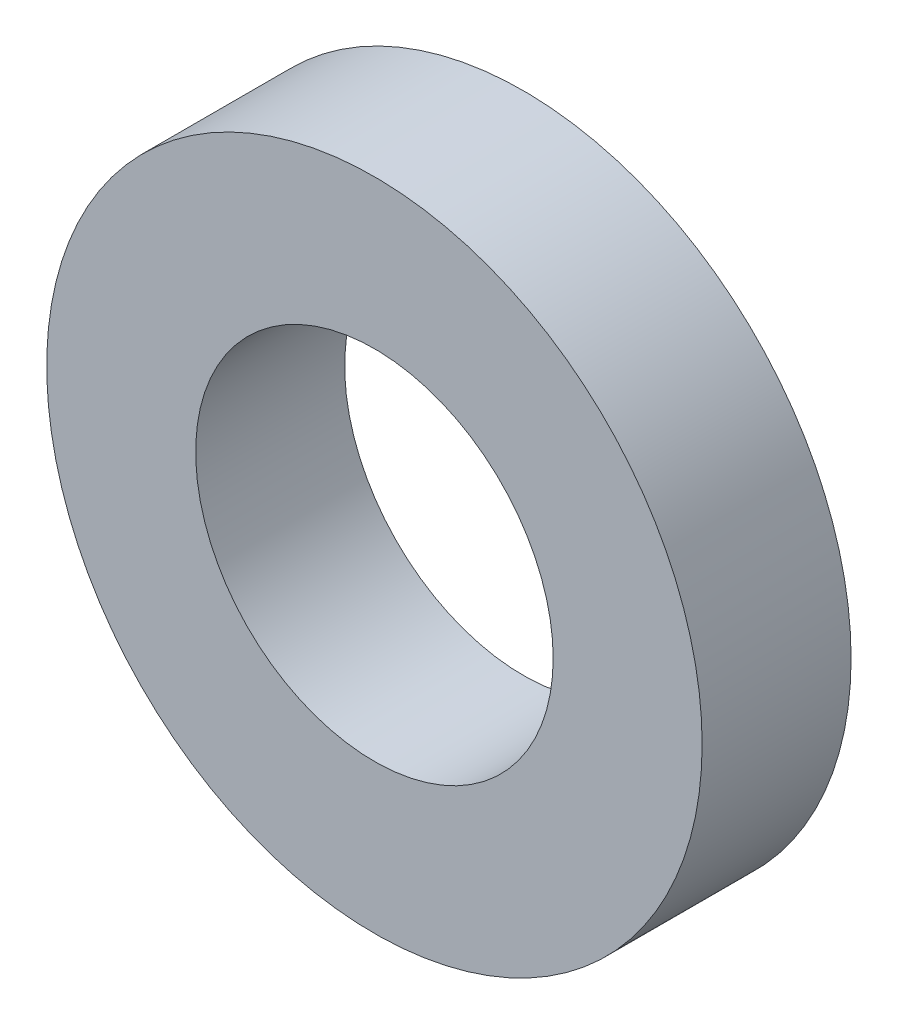
ISO-10303-21;
HEADER;
FILE_DESCRIPTION(('STEP AP214'),'2;1');
FILE_NAME('part.step','',(''),(''),'','','');
FILE_SCHEMA(('AUTOMOTIVE_DESIGN { 1 0 10303 214 1 1 1 1 }'));
ENDSEC;
DATA;
#1=APPLICATION_CONTEXT('core data for automotive mechanical design processes');
#2=APPLICATION_PROTOCOL_DEFINITION('international standard','automotive_design',2000,#1);
#3=PRODUCT_CONTEXT('',#1,'mechanical');
#4=PRODUCT('Part','Part','',(#3));
#5=PRODUCT_RELATED_PRODUCT_CATEGORY('part','',(#4));
#6=PRODUCT_DEFINITION_FORMATION('','',#4);
#7=PRODUCT_DEFINITION_CONTEXT('part definition',#1,'design');
#8=PRODUCT_DEFINITION('design','',#6,#7);
#9=PRODUCT_DEFINITION_SHAPE('','',#8);
#10=(LENGTH_UNIT() NAMED_UNIT(*) SI_UNIT(.MILLI.,.METRE.));
#11=(NAMED_UNIT(*) PLANE_ANGLE_UNIT() SI_UNIT($,.RADIAN.));
#12=(NAMED_UNIT(*) SI_UNIT($,.STERADIAN.) SOLID_ANGLE_UNIT());
#13=UNCERTAINTY_MEASURE_WITH_UNIT(LENGTH_MEASURE(1.E-05),#10,'distance_accuracy_value','');
#14=(GEOMETRIC_REPRESENTATION_CONTEXT(3) GLOBAL_UNCERTAINTY_ASSIGNED_CONTEXT((#13)) GLOBAL_UNIT_ASSIGNED_CONTEXT((#10,
#11,#12)) REPRESENTATION_CONTEXT('',''));
#15=CARTESIAN_POINT('',(0.,0.,0.));
#16=DIRECTION('',(0.,0.,1.));
#17=DIRECTION('',(1.,0.,0.));
#18=AXIS2_PLACEMENT_3D('',#15,#16,#17);
#19=CARTESIAN_POINT('',(0.,0.,5.));
#20=DIRECTION('',(0.,0.,1.));
#21=DIRECTION('',(1.,0.,0.));
#22=AXIS2_PLACEMENT_3D('',#19,#20,#21);
#23=PLANE('',#22);
#24=CARTESIAN_POINT('',(0.,0.,5.));
#25=DIRECTION('',(0.,0.,1.));
#26=DIRECTION('',(1.,0.,0.));
#27=AXIS2_PLACEMENT_3D('',#24,#25,#26);
#28=CIRCLE('',#27,11.);
#29=CARTESIAN_POINT('',(11.,0.,5.));
#30=VERTEX_POINT('',#29);
#31=EDGE_CURVE('E12',#30,#30,#28,.T.);
#32=ORIENTED_EDGE('',*,*,#31,.T.);
#33=EDGE_LOOP('',(#32));
#34=FACE_BOUND('',#33,.T.);
#35=CARTESIAN_POINT('',(0.,0.,5.));
#36=DIRECTION('',(0.,0.,1.));
#37=DIRECTION('',(1.,0.,0.));
#38=AXIS2_PLACEMENT_3D('',#35,#36,#37);
#39=CIRCLE('',#38,6.);
#40=CARTESIAN_POINT('',(6.,0.,5.));
#41=VERTEX_POINT('',#40);
#42=EDGE_CURVE('E51',#41,#41,#39,.T.);
#43=ORIENTED_EDGE('',*,*,#42,.F.);
#44=EDGE_LOOP('',(#43));
#45=FACE_BOUND('',#44,.T.);
#46=ADVANCED_FACE('F40',(#34,#45),#23,.T.);
#47=CARTESIAN_POINT('',(0.,0.,0.));
#48=DIRECTION('',(0.,0.,1.));
#49=DIRECTION('',(1.,0.,0.));
#50=AXIS2_PLACEMENT_3D('',#47,#48,#49);
#51=PLANE('',#50);
#52=CARTESIAN_POINT('',(0.,0.,0.));
#53=DIRECTION('',(0.,0.,1.));
#54=DIRECTION('',(1.,0.,0.));
#55=AXIS2_PLACEMENT_3D('',#52,#53,#54);
#56=CIRCLE('',#55,11.);
#57=CARTESIAN_POINT('',(11.,0.,0.));
#58=VERTEX_POINT('',#57);
#59=EDGE_CURVE('E44',#58,#58,#56,.T.);
#60=ORIENTED_EDGE('',*,*,#59,.F.);
#61=EDGE_LOOP('',(#60));
#62=FACE_BOUND('',#61,.T.);
#63=CARTESIAN_POINT('',(0.,0.,0.));
#64=DIRECTION('',(0.,0.,1.));
#65=DIRECTION('',(1.,0.,0.));
#66=AXIS2_PLACEMENT_3D('',#63,#64,#65);
#67=CIRCLE('',#66,6.);
#68=CARTESIAN_POINT('',(6.,0.,0.));
#69=VERTEX_POINT('',#68);
#70=EDGE_CURVE('E53',#69,#69,#67,.T.);
#71=ORIENTED_EDGE('',*,*,#70,.T.);
#72=EDGE_LOOP('',(#71));
#73=FACE_BOUND('',#72,.T.);
#74=ADVANCED_FACE('F63',(#62,#73),#51,.F.);
#75=CARTESIAN_POINT('',(0.,0.,5.));
#76=DIRECTION('',(0.,0.,-1.));
#77=DIRECTION('',(-1.,0.,0.));
#78=AXIS2_PLACEMENT_3D('',#75,#76,#77);
#79=CYLINDRICAL_SURFACE('',#78,11.);
#80=ORIENTED_EDGE('',*,*,#31,.F.);
#81=EDGE_LOOP('',(#80));
#82=FACE_BOUND('',#81,.T.);
#83=ORIENTED_EDGE('',*,*,#59,.T.);
#84=EDGE_LOOP('',(#83));
#85=FACE_BOUND('',#84,.T.);
#86=ADVANCED_FACE('F42',(#82,#85),#79,.T.);
#87=CARTESIAN_POINT('',(0.,0.,5.));
#88=DIRECTION('',(0.,0.,-1.));
#89=DIRECTION('',(-1.,0.,0.));
#90=AXIS2_PLACEMENT_3D('',#87,#88,#89);
#91=CYLINDRICAL_SURFACE('',#90,6.);
#92=ORIENTED_EDGE('',*,*,#42,.T.);
#93=EDGE_LOOP('',(#92));
#94=FACE_BOUND('',#93,.T.);
#95=ORIENTED_EDGE('',*,*,#70,.F.);
#96=EDGE_LOOP('',(#95));
#97=FACE_BOUND('',#96,.T.);
#98=ADVANCED_FACE('F59',(#94,#97),#91,.F.);
#99=CLOSED_SHELL('',(#46,#74,#86,#98));
#100=MANIFOLD_SOLID_BREP('B2',#99);
#101=ADVANCED_BREP_SHAPE_REPRESENTATION('',(#18,#100),#14);
#102=SHAPE_DEFINITION_REPRESENTATION(#9,#101);
ENDSEC;
END-ISO-10303-21;
